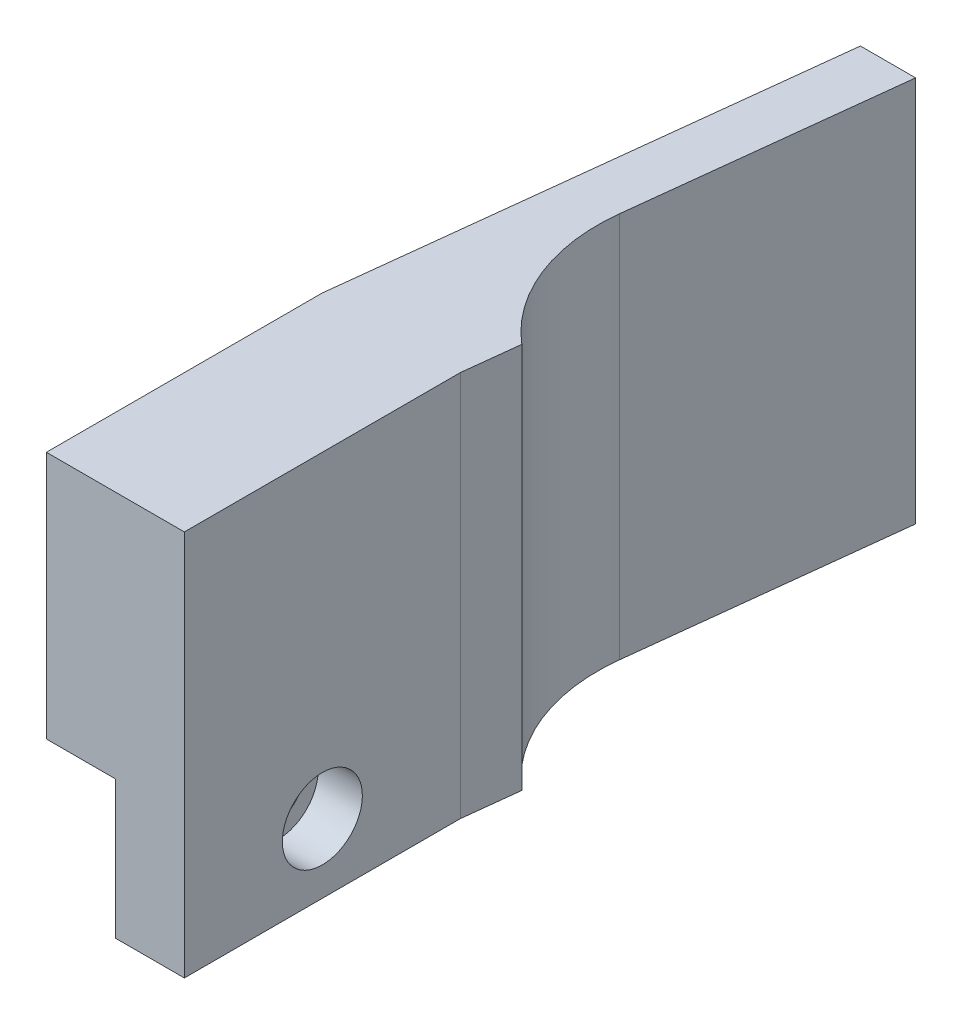
ISO-10303-21;
HEADER;
FILE_DESCRIPTION(('STEP AP214'),'2;1');
FILE_NAME('part.step','',(''),(''),'','','');
FILE_SCHEMA(('AUTOMOTIVE_DESIGN { 1 0 10303 214 1 1 1 1 }'));
ENDSEC;
DATA;
#1=APPLICATION_CONTEXT('core data for automotive mechanical design processes');
#2=APPLICATION_PROTOCOL_DEFINITION('international standard','automotive_design',2000,#1);
#3=PRODUCT_CONTEXT('',#1,'mechanical');
#4=PRODUCT('Part','Part','',(#3));
#5=PRODUCT_RELATED_PRODUCT_CATEGORY('part','',(#4));
#6=PRODUCT_DEFINITION_FORMATION('','',#4);
#7=PRODUCT_DEFINITION_CONTEXT('part definition',#1,'design');
#8=PRODUCT_DEFINITION('design','',#6,#7);
#9=PRODUCT_DEFINITION_SHAPE('','',#8);
#10=(LENGTH_UNIT() NAMED_UNIT(*) SI_UNIT(.MILLI.,.METRE.));
#11=(NAMED_UNIT(*) PLANE_ANGLE_UNIT() SI_UNIT($,.RADIAN.));
#12=(NAMED_UNIT(*) SI_UNIT($,.STERADIAN.) SOLID_ANGLE_UNIT());
#13=UNCERTAINTY_MEASURE_WITH_UNIT(LENGTH_MEASURE(1.E-05),#10,'distance_accuracy_value','');
#14=(GEOMETRIC_REPRESENTATION_CONTEXT(3) GLOBAL_UNCERTAINTY_ASSIGNED_CONTEXT((#13)) GLOBAL_UNIT_ASSIGNED_CONTEXT((#10,
#11,#12)) REPRESENTATION_CONTEXT('',''));
#15=CARTESIAN_POINT('',(0.,0.,0.));
#16=DIRECTION('',(0.,0.,1.));
#17=DIRECTION('',(1.,0.,0.));
#18=AXIS2_PLACEMENT_3D('',#15,#16,#17);
#19=CARTESIAN_POINT('',(6.35000000000001,-6.35,0.));
#20=DIRECTION('',(-1.,0.,0.));
#21=DIRECTION('',(0.,-1.,0.));
#22=AXIS2_PLACEMENT_3D('',#19,#20,#21);
#23=CYLINDRICAL_SURFACE('',#22,2.159);
#24=CARTESIAN_POINT('',(0.,-6.35,0.));
#25=DIRECTION('',(-1.,0.,0.));
#26=DIRECTION('',(0.,-1.,0.));
#27=AXIS2_PLACEMENT_3D('',#24,#25,#26);
#28=CIRCLE('',#27,2.159);
#29=CARTESIAN_POINT('',(0.,-8.509,0.));
#30=VERTEX_POINT('',#29);
#31=EDGE_CURVE('E167',#30,#30,#28,.T.);
#32=ORIENTED_EDGE('',*,*,#31,.T.);
#33=EDGE_LOOP('',(#32));
#34=FACE_BOUND('',#33,.T.);
#35=CARTESIAN_POINT('',(2.286,-6.35,0.));
#36=DIRECTION('',(1.,0.,0.));
#37=DIRECTION('',(0.,1.,0.));
#38=AXIS2_PLACEMENT_3D('',#35,#36,#37);
#39=CIRCLE('',#38,2.159);
#40=CARTESIAN_POINT('',(2.286,-4.191,0.));
#41=VERTEX_POINT('',#40);
#42=EDGE_CURVE('E160',#41,#41,#39,.T.);
#43=ORIENTED_EDGE('',*,*,#42,.T.);
#44=EDGE_LOOP('',(#43));
#45=FACE_BOUND('',#44,.T.);
#46=ADVANCED_FACE('F39',(#34,#45),#23,.F.);
#47=CARTESIAN_POINT('',(6.35,0.,12.7));
#48=DIRECTION('',(1.,0.,0.));
#49=DIRECTION('',(0.,1.,0.));
#50=AXIS2_PLACEMENT_3D('',#47,#48,#49);
#51=PLANE('',#50);
#52=CARTESIAN_POINT('',(6.35,-6.35,0.));
#53=DIRECTION('',(1.,0.,0.));
#54=DIRECTION('',(0.,1.,0.));
#55=AXIS2_PLACEMENT_3D('',#52,#53,#54);
#56=CIRCLE('',#55,3.683);
#57=CARTESIAN_POINT('',(6.35,-2.667,0.));
#58=VERTEX_POINT('',#57);
#59=EDGE_CURVE('E163',#58,#58,#56,.T.);
#60=ORIENTED_EDGE('',*,*,#59,.F.);
#61=EDGE_LOOP('',(#60));
#62=FACE_BOUND('',#61,.T.);
#63=DIRECTION('',(0.,-1.,0.));
#64=VECTOR('',#63,1.);
#65=CARTESIAN_POINT('',(6.35,0.,-12.7));
#66=LINE('',#65,#64);
#67=CARTESIAN_POINT('',(6.35000000000001,22.86,-12.7));
#68=VERTEX_POINT('',#67);
#69=CARTESIAN_POINT('',(6.35,-12.7,-12.7));
#70=VERTEX_POINT('',#69);
#71=EDGE_CURVE('E172',#68,#70,#66,.T.);
#72=ORIENTED_EDGE('',*,*,#71,.F.);
#73=DIRECTION('',(0.,0.,-1.));
#74=VECTOR('',#73,1.);
#75=CARTESIAN_POINT('',(6.34999999999999,22.86,12.7));
#76=LINE('',#75,#74);
#77=CARTESIAN_POINT('',(6.34999999999999,22.86,12.7));
#78=VERTEX_POINT('',#77);
#79=EDGE_CURVE('E11',#78,#68,#76,.T.);
#80=ORIENTED_EDGE('',*,*,#79,.F.);
#81=DIRECTION('',(0.,-1.,0.));
#82=VECTOR('',#81,1.);
#83=CARTESIAN_POINT('',(6.35,0.,12.7));
#84=LINE('',#83,#82);
#85=CARTESIAN_POINT('',(6.35,-12.7,12.7));
#86=VERTEX_POINT('',#85);
#87=EDGE_CURVE('E173',#78,#86,#84,.T.);
#88=ORIENTED_EDGE('',*,*,#87,.T.);
#89=DIRECTION('',(0.,0.,-1.));
#90=VECTOR('',#89,1.);
#91=CARTESIAN_POINT('',(6.35,-12.7,12.7));
#92=LINE('',#91,#90);
#93=EDGE_CURVE('E186',#86,#70,#92,.T.);
#94=ORIENTED_EDGE('',*,*,#93,.T.);
#95=EDGE_LOOP('',(#72,#80,#88,#94));
#96=FACE_BOUND('',#95,.T.);
#97=ADVANCED_FACE('F41',(#62,#96),#51,.T.);
#98=CARTESIAN_POINT('',(0.,22.86,12.7));
#99=DIRECTION('',(0.,1.,0.));
#100=DIRECTION('',(0.,0.,1.));
#101=AXIS2_PLACEMENT_3D('',#98,#99,#100);
#102=PLANE('',#101);
#103=ORIENTED_EDGE('',*,*,#79,.T.);
#104=DIRECTION('',(0.113546591160732,0.,-0.993532672656404));
#105=VECTOR('',#104,1.);
#106=CARTESIAN_POINT('',(4.83541498791299,22.86,0.552618855761482));
#107=LINE('',#106,#105);
#108=CARTESIAN_POINT('',(6.93057142857144,22.86,-17.78));
#109=VERTEX_POINT('',#108);
#110=EDGE_CURVE('E113',#68,#109,#107,.T.);
#111=ORIENTED_EDGE('',*,*,#110,.T.);
#112=CARTESIAN_POINT('',(17.9312532473444,22.86,-30.7735259105486));
#113=DIRECTION('',(0.,1.,0.));
#114=DIRECTION('',(0.,0.,1.));
#115=AXIS2_PLACEMENT_3D('',#112,#113,#114);
#116=CIRCLE('',#115,17.0248851997885);
#117=CARTESIAN_POINT('',(1.01647355312999,22.86,-32.7066435898874));
#118=VERTEX_POINT('',#117);
#119=EDGE_CURVE('E117',#118,#109,#116,.T.);
#120=ORIENTED_EDGE('',*,*,#119,.F.);
#121=DIRECTION('',(-0.113546591160732,0.,0.993532672656404));
#122=VECTOR('',#121,1.);
#123=CARTESIAN_POINT('',(-2.68634165995165,22.86,-0.307010475423048));
#124=LINE('',#123,#122);
#125=CARTESIAN_POINT('',(3.81000000000002,22.86,-57.15));
#126=VERTEX_POINT('',#125);
#127=EDGE_CURVE('E144',#126,#118,#124,.T.);
#128=ORIENTED_EDGE('',*,*,#127,.F.);
#129=DIRECTION('',(1.,0.,0.));
#130=VECTOR('',#129,1.);
#131=CARTESIAN_POINT('',(0.,22.86,-57.15));
#132=LINE('',#131,#130);
#133=CARTESIAN_POINT('',(-1.26999999999999,22.86,-57.15));
#134=VERTEX_POINT('',#133);
#135=EDGE_CURVE('E147',#134,#126,#132,.T.);
#136=ORIENTED_EDGE('',*,*,#135,.F.);
#137=DIRECTION('',(0.113546591160732,0.,-0.993532672656404));
#138=VECTOR('',#137,1.);
#139=CARTESIAN_POINT('',(-7.7008460918614,22.86,-0.880096696212733));
#140=LINE('',#139,#138);
#141=CARTESIAN_POINT('',(-6.35,22.86,-12.7));
#142=VERTEX_POINT('',#141);
#143=EDGE_CURVE('E151',#142,#134,#140,.T.);
#144=ORIENTED_EDGE('',*,*,#143,.F.);
#145=DIRECTION('',(0.,0.,-1.));
#146=VECTOR('',#145,1.);
#147=CARTESIAN_POINT('',(-6.35000000000001,22.86,12.7));
#148=LINE('',#147,#146);
#149=CARTESIAN_POINT('',(-6.35000000000001,22.86,12.7));
#150=VERTEX_POINT('',#149);
#151=EDGE_CURVE('E48',#150,#142,#148,.T.);
#152=ORIENTED_EDGE('',*,*,#151,.F.);
#153=DIRECTION('',(1.,0.,0.));
#154=VECTOR('',#153,1.);
#155=CARTESIAN_POINT('',(0.,22.86,12.7));
#156=LINE('',#155,#154);
#157=EDGE_CURVE('E176',#150,#78,#156,.T.);
#158=ORIENTED_EDGE('',*,*,#157,.T.);
#159=EDGE_LOOP('',(#103,#111,#120,#128,#136,#144,#152,#158));
#160=FACE_BOUND('',#159,.T.);
#161=ADVANCED_FACE('F115',(#160),#102,.T.);
#162=CARTESIAN_POINT('',(-6.35,0.,12.7));
#163=DIRECTION('',(1.,0.,0.));
#164=DIRECTION('',(0.,1.,0.));
#165=AXIS2_PLACEMENT_3D('',#162,#163,#164);
#166=PLANE('',#165);
#167=DIRECTION('',(0.,-1.,0.));
#168=VECTOR('',#167,1.);
#169=CARTESIAN_POINT('',(-6.35,0.,-12.7));
#170=LINE('',#169,#168);
#171=CARTESIAN_POINT('',(-6.35,0.,-12.7));
#172=VERTEX_POINT('',#171);
#173=EDGE_CURVE('E188',#142,#172,#170,.T.);
#174=ORIENTED_EDGE('',*,*,#173,.T.);
#175=DIRECTION('',(0.,0.,-1.));
#176=VECTOR('',#175,1.);
#177=CARTESIAN_POINT('',(-6.35,0.,12.7));
#178=LINE('',#177,#176);
#179=CARTESIAN_POINT('',(-6.35,0.,12.7));
#180=VERTEX_POINT('',#179);
#181=EDGE_CURVE('E204',#180,#172,#178,.T.);
#182=ORIENTED_EDGE('',*,*,#181,.F.);
#183=DIRECTION('',(0.,-1.,0.));
#184=VECTOR('',#183,1.);
#185=CARTESIAN_POINT('',(-6.35,0.,12.7));
#186=LINE('',#185,#184);
#187=EDGE_CURVE('E179',#150,#180,#186,.T.);
#188=ORIENTED_EDGE('',*,*,#187,.F.);
#189=ORIENTED_EDGE('',*,*,#151,.T.);
#190=EDGE_LOOP('',(#174,#182,#188,#189));
#191=FACE_BOUND('',#190,.T.);
#192=ADVANCED_FACE('F209',(#191),#166,.F.);
#193=CARTESIAN_POINT('',(0.,0.,12.7));
#194=DIRECTION('',(0.,1.,0.));
#195=DIRECTION('',(-1.,0.,0.));
#196=AXIS2_PLACEMENT_3D('',#193,#194,#195);
#197=PLANE('',#196);
#198=DIRECTION('',(1.,0.,0.));
#199=VECTOR('',#198,1.);
#200=CARTESIAN_POINT('',(0.,0.,-12.7));
#201=LINE('',#200,#199);
#202=CARTESIAN_POINT('',(0.,0.,-12.7));
#203=VERTEX_POINT('',#202);
#204=EDGE_CURVE('E191',#172,#203,#201,.T.);
#205=ORIENTED_EDGE('',*,*,#204,.T.);
#206=DIRECTION('',(0.,0.,-1.));
#207=VECTOR('',#206,1.);
#208=CARTESIAN_POINT('',(0.,0.,12.7));
#209=LINE('',#208,#207);
#210=CARTESIAN_POINT('',(0.,0.,12.7));
#211=VERTEX_POINT('',#210);
#212=EDGE_CURVE('E201',#211,#203,#209,.T.);
#213=ORIENTED_EDGE('',*,*,#212,.F.);
#214=DIRECTION('',(1.,0.,0.));
#215=VECTOR('',#214,1.);
#216=CARTESIAN_POINT('',(0.,0.,12.7));
#217=LINE('',#216,#215);
#218=EDGE_CURVE('E181',#180,#211,#217,.T.);
#219=ORIENTED_EDGE('',*,*,#218,.F.);
#220=ORIENTED_EDGE('',*,*,#181,.T.);
#221=EDGE_LOOP('',(#205,#213,#219,#220));
#222=FACE_BOUND('',#221,.T.);
#223=ADVANCED_FACE('F266',(#222),#197,.F.);
#224=CARTESIAN_POINT('',(0.,0.,12.7));
#225=DIRECTION('',(1.,0.,0.));
#226=DIRECTION('',(0.,1.,0.));
#227=AXIS2_PLACEMENT_3D('',#224,#225,#226);
#228=PLANE('',#227);
#229=ORIENTED_EDGE('',*,*,#31,.F.);
#230=EDGE_LOOP('',(#229));
#231=FACE_BOUND('',#230,.T.);
#232=DIRECTION('',(0.,-1.,0.));
#233=VECTOR('',#232,1.);
#234=CARTESIAN_POINT('',(0.,0.,-12.7));
#235=LINE('',#234,#233);
#236=CARTESIAN_POINT('',(0.,-12.7,-12.7));
#237=VERTEX_POINT('',#236);
#238=EDGE_CURVE('E177',#203,#237,#235,.T.);
#239=ORIENTED_EDGE('',*,*,#238,.T.);
#240=DIRECTION('',(0.,0.,-1.));
#241=VECTOR('',#240,1.);
#242=CARTESIAN_POINT('',(0.,-12.7,12.7));
#243=LINE('',#242,#241);
#244=CARTESIAN_POINT('',(0.,-12.7,12.7));
#245=VERTEX_POINT('',#244);
#246=EDGE_CURVE('E198',#245,#237,#243,.T.);
#247=ORIENTED_EDGE('',*,*,#246,.F.);
#248=DIRECTION('',(0.,-1.,0.));
#249=VECTOR('',#248,1.);
#250=CARTESIAN_POINT('',(0.,0.,12.7));
#251=LINE('',#250,#249);
#252=EDGE_CURVE('E183',#211,#245,#251,.T.);
#253=ORIENTED_EDGE('',*,*,#252,.F.);
#254=ORIENTED_EDGE('',*,*,#212,.T.);
#255=EDGE_LOOP('',(#239,#247,#253,#254));
#256=FACE_BOUND('',#255,.T.);
#257=ADVANCED_FACE('F263',(#231,#256),#228,.F.);
#258=CARTESIAN_POINT('',(0.,-12.7,12.7));
#259=DIRECTION('',(0.,1.,0.));
#260=DIRECTION('',(-1.,0.,0.));
#261=AXIS2_PLACEMENT_3D('',#258,#259,#260);
#262=PLANE('',#261);
#263=ORIENTED_EDGE('',*,*,#246,.T.);
#264=DIRECTION('',(1.,0.,0.));
#265=VECTOR('',#264,1.);
#266=CARTESIAN_POINT('',(0.,-12.7,-12.7));
#267=LINE('',#266,#265);
#268=CARTESIAN_POINT('',(-6.35,-12.7,-12.7));
#269=VERTEX_POINT('',#268);
#270=EDGE_CURVE('E153',#269,#237,#267,.T.);
#271=ORIENTED_EDGE('',*,*,#270,.F.);
#272=DIRECTION('',(0.113546591160732,0.,-0.993532672656404));
#273=VECTOR('',#272,1.);
#274=CARTESIAN_POINT('',(-7.70084609186141,-12.7,-0.880096696212732));
#275=LINE('',#274,#273);
#276=CARTESIAN_POINT('',(-1.27,-12.7,-57.15));
#277=VERTEX_POINT('',#276);
#278=EDGE_CURVE('E139',#269,#277,#275,.T.);
#279=ORIENTED_EDGE('',*,*,#278,.T.);
#280=DIRECTION('',(1.,0.,0.));
#281=VECTOR('',#280,1.);
#282=CARTESIAN_POINT('',(0.,-12.7,-57.15));
#283=LINE('',#282,#281);
#284=CARTESIAN_POINT('',(3.81,-12.7,-57.15));
#285=VERTEX_POINT('',#284);
#286=EDGE_CURVE('E136',#277,#285,#283,.T.);
#287=ORIENTED_EDGE('',*,*,#286,.T.);
#288=DIRECTION('',(-0.113546591160732,0.,0.993532672656404));
#289=VECTOR('',#288,1.);
#290=CARTESIAN_POINT('',(-2.68634165995166,-12.7,-0.307010475423046));
#291=LINE('',#290,#289);
#292=CARTESIAN_POINT('',(1.01647355312998,-12.7,-32.7066435898874));
#293=VERTEX_POINT('',#292);
#294=EDGE_CURVE('E122',#285,#293,#291,.T.);
#295=ORIENTED_EDGE('',*,*,#294,.T.);
#296=CARTESIAN_POINT('',(17.9312532473444,-12.7,-30.7735259105486));
#297=DIRECTION('',(0.,-1.,0.));
#298=DIRECTION('',(1.,0.,0.));
#299=AXIS2_PLACEMENT_3D('',#296,#297,#298);
#300=CIRCLE('',#299,17.0248851997885);
#301=CARTESIAN_POINT('',(6.93057142857143,-12.7,-17.78));
#302=VERTEX_POINT('',#301);
#303=EDGE_CURVE('E230',#293,#302,#300,.F.);
#304=ORIENTED_EDGE('',*,*,#303,.T.);
#305=DIRECTION('',(0.113546591160732,0.,-0.993532672656404));
#306=VECTOR('',#305,1.);
#307=CARTESIAN_POINT('',(4.83541498791297,-12.7,0.552618855761483));
#308=LINE('',#307,#306);
#309=EDGE_CURVE('E128',#70,#302,#308,.T.);
#310=ORIENTED_EDGE('',*,*,#309,.F.);
#311=ORIENTED_EDGE('',*,*,#93,.F.);
#312=DIRECTION('',(1.,0.,0.));
#313=VECTOR('',#312,1.);
#314=CARTESIAN_POINT('',(0.,-12.7,12.7));
#315=LINE('',#314,#313);
#316=EDGE_CURVE('E55',#245,#86,#315,.T.);
#317=ORIENTED_EDGE('',*,*,#316,.F.);
#318=EDGE_LOOP('',(#263,#271,#279,#287,#295,#304,#310,#311,#317));
#319=FACE_BOUND('',#318,.T.);
#320=ADVANCED_FACE('F224',(#319),#262,.F.);
#321=CARTESIAN_POINT('',(0.,0.,12.7));
#322=DIRECTION('',(0.,0.,1.));
#323=DIRECTION('',(1.,0.,0.));
#324=AXIS2_PLACEMENT_3D('',#321,#322,#323);
#325=PLANE('',#324);
#326=ORIENTED_EDGE('',*,*,#87,.F.);
#327=ORIENTED_EDGE('',*,*,#157,.F.);
#328=ORIENTED_EDGE('',*,*,#187,.T.);
#329=ORIENTED_EDGE('',*,*,#218,.T.);
#330=ORIENTED_EDGE('',*,*,#252,.T.);
#331=ORIENTED_EDGE('',*,*,#316,.T.);
#332=EDGE_LOOP('',(#326,#327,#328,#329,#330,#331));
#333=FACE_BOUND('',#332,.T.);
#334=ADVANCED_FACE('F258',(#333),#325,.T.);
#335=CARTESIAN_POINT('',(2.286,-6.35,0.));
#336=DIRECTION('',(1.,0.,0.));
#337=DIRECTION('',(0.,1.,0.));
#338=AXIS2_PLACEMENT_3D('',#335,#336,#337);
#339=CYLINDRICAL_SURFACE('',#338,3.683);
#340=CARTESIAN_POINT('',(2.286,-6.35,0.));
#341=DIRECTION('',(1.,0.,0.));
#342=DIRECTION('',(0.,1.,0.));
#343=AXIS2_PLACEMENT_3D('',#340,#341,#342);
#344=CIRCLE('',#343,3.683);
#345=CARTESIAN_POINT('',(2.286,-2.667,0.));
#346=VERTEX_POINT('',#345);
#347=EDGE_CURVE('E164',#346,#346,#344,.T.);
#348=ORIENTED_EDGE('',*,*,#347,.F.);
#349=EDGE_LOOP('',(#348));
#350=FACE_BOUND('',#349,.T.);
#351=ORIENTED_EDGE('',*,*,#59,.T.);
#352=EDGE_LOOP('',(#351));
#353=FACE_BOUND('',#352,.T.);
#354=ADVANCED_FACE('F256',(#350,#353),#339,.F.);
#355=CARTESIAN_POINT('',(2.286,-6.35,0.));
#356=DIRECTION('',(1.,0.,0.));
#357=DIRECTION('',(0.,1.,0.));
#358=AXIS2_PLACEMENT_3D('',#355,#356,#357);
#359=PLANE('',#358);
#360=ORIENTED_EDGE('',*,*,#42,.F.);
#361=EDGE_LOOP('',(#360));
#362=FACE_BOUND('',#361,.T.);
#363=ORIENTED_EDGE('',*,*,#347,.T.);
#364=EDGE_LOOP('',(#363));
#365=FACE_BOUND('',#364,.T.);
#366=ADVANCED_FACE('F304',(#362,#365),#359,.T.);
#367=CARTESIAN_POINT('',(17.9312532473444,69.2515517898398,-30.7735259105486));
#368=DIRECTION('',(0.,-1.,0.));
#369=DIRECTION('',(1.,0.,0.));
#370=AXIS2_PLACEMENT_3D('',#367,#368,#369);
#371=CYLINDRICAL_SURFACE('',#370,17.0248851997885);
#372=DIRECTION('',(0.,-1.,0.));
#373=VECTOR('',#372,1.);
#374=CARTESIAN_POINT('',(1.01647355313,69.2515517898398,-32.7066435898874));
#375=LINE('',#374,#373);
#376=EDGE_CURVE('E135',#118,#293,#375,.T.);
#377=ORIENTED_EDGE('',*,*,#376,.F.);
#378=ORIENTED_EDGE('',*,*,#119,.T.);
#379=DIRECTION('',(0.,-1.,0.));
#380=VECTOR('',#379,1.);
#381=CARTESIAN_POINT('',(6.93057142857145,69.2515517898398,-17.78));
#382=LINE('',#381,#380);
#383=EDGE_CURVE('E125',#109,#302,#382,.T.);
#384=ORIENTED_EDGE('',*,*,#383,.T.);
#385=ORIENTED_EDGE('',*,*,#303,.F.);
#386=EDGE_LOOP('',(#377,#378,#384,#385));
#387=FACE_BOUND('',#386,.T.);
#388=ADVANCED_FACE('F134',(#387),#371,.F.);
#389=CARTESIAN_POINT('',(4.835414987913,69.2515517898398,0.552618855761483));
#390=DIRECTION('',(-0.993532672656404,0.,-0.113546591160732));
#391=DIRECTION('',(-0.113546591160732,0.,0.993532672656404));
#392=AXIS2_PLACEMENT_3D('',#389,#390,#391);
#393=PLANE('',#392);
#394=ORIENTED_EDGE('',*,*,#110,.F.);
#395=ORIENTED_EDGE('',*,*,#71,.T.);
#396=ORIENTED_EDGE('',*,*,#309,.T.);
#397=ORIENTED_EDGE('',*,*,#383,.F.);
#398=EDGE_LOOP('',(#394,#395,#396,#397));
#399=FACE_BOUND('',#398,.T.);
#400=ADVANCED_FACE('F126',(#399),#393,.F.);
#401=CARTESIAN_POINT('',(0.,69.2515517898398,-12.7));
#402=DIRECTION('',(0.,0.,-1.));
#403=DIRECTION('',(-1.,0.,0.));
#404=AXIS2_PLACEMENT_3D('',#401,#402,#403);
#405=PLANE('',#404);
#406=ORIENTED_EDGE('',*,*,#238,.F.);
#407=ORIENTED_EDGE('',*,*,#204,.F.);
#408=DIRECTION('',(0.,-1.,0.));
#409=VECTOR('',#408,1.);
#410=CARTESIAN_POINT('',(-6.34999999999998,69.2515517898398,-12.7));
#411=LINE('',#410,#409);
#412=EDGE_CURVE('E157',#172,#269,#411,.T.);
#413=ORIENTED_EDGE('',*,*,#412,.T.);
#414=ORIENTED_EDGE('',*,*,#270,.T.);
#415=EDGE_LOOP('',(#406,#407,#413,#414));
#416=FACE_BOUND('',#415,.T.);
#417=ADVANCED_FACE('F222',(#416),#405,.F.);
#418=CARTESIAN_POINT('',(-7.70084609186138,69.2515517898398,-0.880096696212732));
#419=DIRECTION('',(-0.993532672656404,0.,-0.113546591160732));
#420=DIRECTION('',(-0.113546591160732,0.,0.993532672656404));
#421=AXIS2_PLACEMENT_3D('',#418,#419,#420);
#422=PLANE('',#421);
#423=ORIENTED_EDGE('',*,*,#173,.F.);
#424=ORIENTED_EDGE('',*,*,#143,.T.);
#425=DIRECTION('',(0.,-1.,0.));
#426=VECTOR('',#425,1.);
#427=CARTESIAN_POINT('',(-1.26999999999998,69.2515517898398,-57.15));
#428=LINE('',#427,#426);
#429=EDGE_CURVE('E150',#134,#277,#428,.T.);
#430=ORIENTED_EDGE('',*,*,#429,.T.);
#431=ORIENTED_EDGE('',*,*,#278,.F.);
#432=ORIENTED_EDGE('',*,*,#412,.F.);
#433=EDGE_LOOP('',(#423,#424,#430,#431,#432));
#434=FACE_BOUND('',#433,.T.);
#435=ADVANCED_FACE('F216',(#434),#422,.T.);
#436=CARTESIAN_POINT('',(0.,69.2515517898398,-57.15));
#437=DIRECTION('',(0.,0.,-1.));
#438=DIRECTION('',(-1.,0.,0.));
#439=AXIS2_PLACEMENT_3D('',#436,#437,#438);
#440=PLANE('',#439);
#441=ORIENTED_EDGE('',*,*,#429,.F.);
#442=ORIENTED_EDGE('',*,*,#135,.T.);
#443=DIRECTION('',(0.,-1.,0.));
#444=VECTOR('',#443,1.);
#445=CARTESIAN_POINT('',(3.81000000000002,69.2515517898398,-57.15));
#446=LINE('',#445,#444);
#447=EDGE_CURVE('E146',#126,#285,#446,.T.);
#448=ORIENTED_EDGE('',*,*,#447,.T.);
#449=ORIENTED_EDGE('',*,*,#286,.F.);
#450=EDGE_LOOP('',(#441,#442,#448,#449));
#451=FACE_BOUND('',#450,.T.);
#452=ADVANCED_FACE('F237',(#451),#440,.T.);
#453=CARTESIAN_POINT('',(-2.68634165995163,69.2515517898398,-0.307010475423046));
#454=DIRECTION('',(0.993532672656404,0.,0.113546591160732));
#455=DIRECTION('',(0.113546591160732,0.,-0.993532672656404));
#456=AXIS2_PLACEMENT_3D('',#453,#454,#455);
#457=PLANE('',#456);
#458=ORIENTED_EDGE('',*,*,#447,.F.);
#459=ORIENTED_EDGE('',*,*,#127,.T.);
#460=ORIENTED_EDGE('',*,*,#376,.T.);
#461=ORIENTED_EDGE('',*,*,#294,.F.);
#462=EDGE_LOOP('',(#458,#459,#460,#461));
#463=FACE_BOUND('',#462,.T.);
#464=ADVANCED_FACE('F235',(#463),#457,.T.);
#465=CLOSED_SHELL('',(#46,#97,#161,#192,#223,#257,#320,#334,#354,#366,#388,#400,#417,#435,#452,#464));
#466=MANIFOLD_SOLID_BREP('B2',#465);
#467=ADVANCED_BREP_SHAPE_REPRESENTATION('',(#18,#466),#14);
#468=SHAPE_DEFINITION_REPRESENTATION(#9,#467);
ENDSEC;
END-ISO-10303-21;
